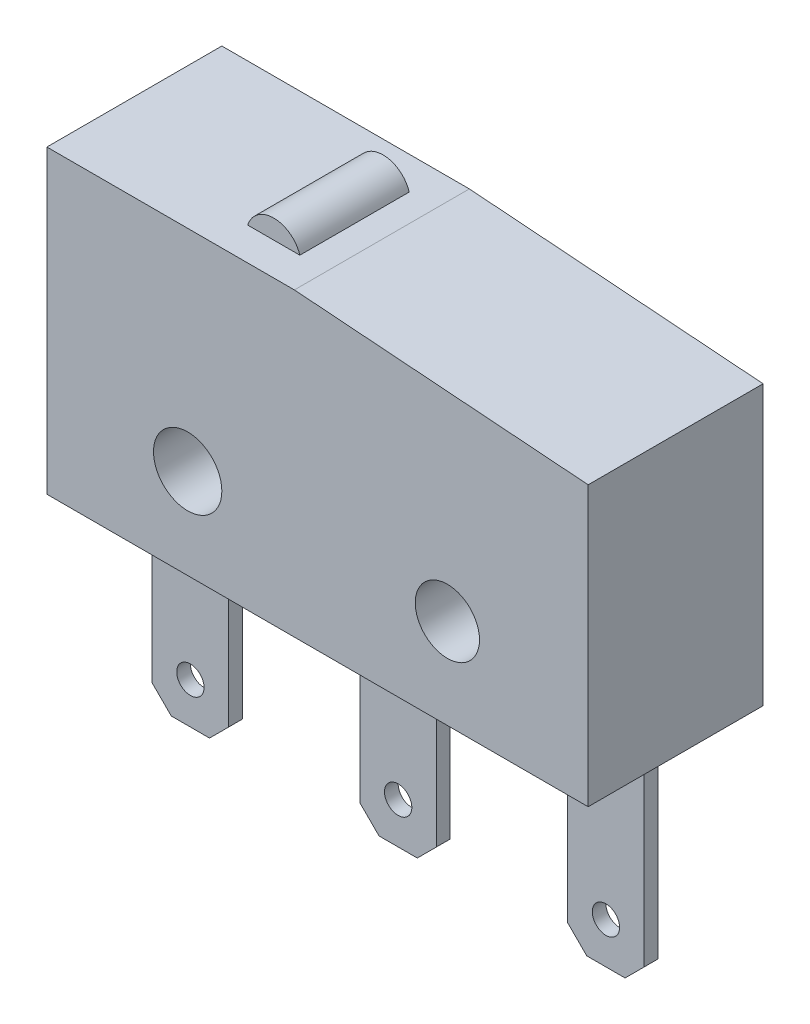
ISO-10303-21;
HEADER;
FILE_DESCRIPTION(('STEP AP214'),'2;1');
FILE_NAME('part.step','',(''),(''),'','','');
FILE_SCHEMA(('AUTOMOTIVE_DESIGN { 1 0 10303 214 1 1 1 1 }'));
ENDSEC;
DATA;
#1=APPLICATION_CONTEXT('core data for automotive mechanical design processes');
#2=APPLICATION_PROTOCOL_DEFINITION('international standard','automotive_design',2000,#1);
#3=PRODUCT_CONTEXT('',#1,'mechanical');
#4=PRODUCT('Part','Part','',(#3));
#5=PRODUCT_RELATED_PRODUCT_CATEGORY('part','',(#4));
#6=PRODUCT_DEFINITION_FORMATION('','',#4);
#7=PRODUCT_DEFINITION_CONTEXT('part definition',#1,'design');
#8=PRODUCT_DEFINITION('design','',#6,#7);
#9=PRODUCT_DEFINITION_SHAPE('','',#8);
#10=(LENGTH_UNIT() NAMED_UNIT(*) SI_UNIT(.MILLI.,.METRE.));
#11=(NAMED_UNIT(*) PLANE_ANGLE_UNIT() SI_UNIT($,.RADIAN.));
#12=(NAMED_UNIT(*) SI_UNIT($,.STERADIAN.) SOLID_ANGLE_UNIT());
#13=UNCERTAINTY_MEASURE_WITH_UNIT(LENGTH_MEASURE(1.E-05),#10,'distance_accuracy_value','');
#14=(GEOMETRIC_REPRESENTATION_CONTEXT(3) GLOBAL_UNCERTAINTY_ASSIGNED_CONTEXT((#13)) GLOBAL_UNIT_ASSIGNED_CONTEXT((#10,
#11,#12)) REPRESENTATION_CONTEXT('',''));
#15=CARTESIAN_POINT('',(0.,0.,0.));
#16=DIRECTION('',(0.,0.,1.));
#17=DIRECTION('',(1.,0.,0.));
#18=AXIS2_PLACEMENT_3D('',#15,#16,#17);
#19=CARTESIAN_POINT('',(1.95,7.4,3.2));
#20=DIRECTION('',(0.,0.,-1.));
#21=DIRECTION('',(-1.,0.,0.));
#22=AXIS2_PLACEMENT_3D('',#19,#20,#21);
#23=CYLINDRICAL_SURFACE('',#22,1.);
#24=CARTESIAN_POINT('',(1.95,7.4,2.));
#25=DIRECTION('',(0.,0.,1.));
#26=DIRECTION('',(1.,0.,0.));
#27=AXIS2_PLACEMENT_3D('',#24,#25,#26);
#28=CIRCLE('',#27,1.);
#29=CARTESIAN_POINT('',(2.90393920141694,7.7,2.));
#30=VERTEX_POINT('',#29);
#31=CARTESIAN_POINT('',(0.99606079858305,7.7,2.));
#32=VERTEX_POINT('',#31);
#33=EDGE_CURVE('E47',#30,#32,#28,.T.);
#34=ORIENTED_EDGE('',*,*,#33,.F.);
#35=DIRECTION('',(0.,0.,-1.));
#36=VECTOR('',#35,1.);
#37=CARTESIAN_POINT('',(2.90393920141694,7.7,3.2));
#38=LINE('',#37,#36);
#39=CARTESIAN_POINT('',(2.90393920141694,7.7,-2.));
#40=VERTEX_POINT('',#39);
#41=EDGE_CURVE('E205',#30,#40,#38,.T.);
#42=ORIENTED_EDGE('',*,*,#41,.T.);
#43=CARTESIAN_POINT('',(1.95,7.4,-2.));
#44=DIRECTION('',(0.,0.,-1.));
#45=DIRECTION('',(-1.,0.,0.));
#46=AXIS2_PLACEMENT_3D('',#43,#44,#45);
#47=CIRCLE('',#46,1.);
#48=CARTESIAN_POINT('',(0.99606079858305,7.7,-2.));
#49=VERTEX_POINT('',#48);
#50=EDGE_CURVE('E11',#49,#40,#47,.T.);
#51=ORIENTED_EDGE('',*,*,#50,.F.);
#52=DIRECTION('',(0.,0.,-1.));
#53=VECTOR('',#52,1.);
#54=CARTESIAN_POINT('',(0.99606079858305,7.7,3.2));
#55=LINE('',#54,#53);
#56=EDGE_CURVE('E206',#32,#49,#55,.T.);
#57=ORIENTED_EDGE('',*,*,#56,.F.);
#58=EDGE_LOOP('',(#34,#42,#51,#57));
#59=FACE_BOUND('',#58,.T.);
#60=ADVANCED_FACE('F33',(#59),#23,.T.);
#61=CARTESIAN_POINT('',(1.95,7.4,-3.2));
#62=DIRECTION('',(0.,0.,1.));
#63=DIRECTION('',(1.,0.,0.));
#64=AXIS2_PLACEMENT_3D('',#61,#62,#63);
#65=PLANE('',#64);
#66=CARTESIAN_POINT('',(9.5,0.,-3.2));
#67=DIRECTION('',(0.,0.,1.));
#68=DIRECTION('',(1.,0.,0.));
#69=AXIS2_PLACEMENT_3D('',#66,#67,#68);
#70=CIRCLE('',#69,1.175);
#71=CARTESIAN_POINT('',(10.675,0.,-3.2));
#72=VERTEX_POINT('',#71);
#73=EDGE_CURVE('E273',#72,#72,#70,.T.);
#74=ORIENTED_EDGE('',*,*,#73,.T.);
#75=EDGE_LOOP('',(#74));
#76=FACE_BOUND('',#75,.T.);
#77=CARTESIAN_POINT('',(0.,0.,-3.2));
#78=DIRECTION('',(0.,0.,1.));
#79=DIRECTION('',(1.,0.,0.));
#80=AXIS2_PLACEMENT_3D('',#77,#78,#79);
#81=CIRCLE('',#80,1.25);
#82=CARTESIAN_POINT('',(1.25,0.,-3.2));
#83=VERTEX_POINT('',#82);
#84=EDGE_CURVE('E248',#83,#83,#81,.T.);
#85=ORIENTED_EDGE('',*,*,#84,.T.);
#86=EDGE_LOOP('',(#85));
#87=FACE_BOUND('',#86,.T.);
#88=DIRECTION('',(-1.,0.,0.));
#89=VECTOR('',#88,1.);
#90=CARTESIAN_POINT('',(0.99606079858305,7.7,-3.2));
#91=LINE('',#90,#89);
#92=CARTESIAN_POINT('',(3.90393920141694,7.7,-3.2));
#93=VERTEX_POINT('',#92);
#94=CARTESIAN_POINT('',(-5.15,7.7,-3.2));
#95=VERTEX_POINT('',#94);
#96=EDGE_CURVE('E258',#93,#95,#91,.T.);
#97=ORIENTED_EDGE('',*,*,#96,.F.);
#98=DIRECTION('',(-0.997240370656576,0.0742404413560044,0.));
#99=VECTOR('',#98,1.);
#100=CARTESIAN_POINT('',(14.65,6.9,-3.2));
#101=LINE('',#100,#99);
#102=CARTESIAN_POINT('',(14.65,6.9,-3.2));
#103=VERTEX_POINT('',#102);
#104=EDGE_CURVE('E255',#103,#93,#101,.T.);
#105=ORIENTED_EDGE('',*,*,#104,.F.);
#106=DIRECTION('',(0.,1.,0.));
#107=VECTOR('',#106,1.);
#108=CARTESIAN_POINT('',(14.65,-3.3,-3.2));
#109=LINE('',#108,#107);
#110=CARTESIAN_POINT('',(14.65,-3.3,-3.2));
#111=VERTEX_POINT('',#110);
#112=EDGE_CURVE('E245',#111,#103,#109,.T.);
#113=ORIENTED_EDGE('',*,*,#112,.F.);
#114=DIRECTION('',(1.,0.,0.));
#115=VECTOR('',#114,1.);
#116=CARTESIAN_POINT('',(-5.15,-3.3,-3.2));
#117=LINE('',#116,#115);
#118=CARTESIAN_POINT('',(-5.15,-3.3,-3.2));
#119=VERTEX_POINT('',#118);
#120=EDGE_CURVE('E232',#119,#111,#117,.T.);
#121=ORIENTED_EDGE('',*,*,#120,.F.);
#122=DIRECTION('',(0.,-1.,0.));
#123=VECTOR('',#122,1.);
#124=CARTESIAN_POINT('',(-5.15,7.7,-3.2));
#125=LINE('',#124,#123);
#126=EDGE_CURVE('E239',#95,#119,#125,.T.);
#127=ORIENTED_EDGE('',*,*,#126,.F.);
#128=EDGE_LOOP('',(#97,#105,#113,#121,#127));
#129=FACE_BOUND('',#128,.T.);
#130=ADVANCED_FACE('F454',(#76,#87,#129),#65,.F.);
#131=CARTESIAN_POINT('',(-5.15,-3.3,3.2));
#132=DIRECTION('',(0.,1.,0.));
#133=DIRECTION('',(-1.,0.,0.));
#134=AXIS2_PLACEMENT_3D('',#131,#132,#133);
#135=PLANE('',#134);
#136=DIRECTION('',(0.,0.,-1.));
#137=VECTOR('',#136,1.);
#138=CARTESIAN_POINT('',(3.35,-3.3,0.25));
#139=LINE('',#138,#137);
#140=CARTESIAN_POINT('',(3.35,-3.3,0.25));
#141=VERTEX_POINT('',#140);
#142=CARTESIAN_POINT('',(3.35,-3.3,-0.25));
#143=VERTEX_POINT('',#142);
#144=EDGE_CURVE('E344',#141,#143,#139,.T.);
#145=ORIENTED_EDGE('',*,*,#144,.F.);
#146=DIRECTION('',(-1.,0.,0.));
#147=VECTOR('',#146,1.);
#148=CARTESIAN_POINT('',(3.35,-3.3,0.25));
#149=LINE('',#148,#147);
#150=CARTESIAN_POINT('',(6.15,-3.3,0.25));
#151=VERTEX_POINT('',#150);
#152=EDGE_CURVE('E347',#151,#141,#149,.T.);
#153=ORIENTED_EDGE('',*,*,#152,.F.);
#154=DIRECTION('',(0.,0.,-1.));
#155=VECTOR('',#154,1.);
#156=CARTESIAN_POINT('',(6.15,-3.3,0.25));
#157=LINE('',#156,#155);
#158=CARTESIAN_POINT('',(6.15,-3.3,-0.25));
#159=VERTEX_POINT('',#158);
#160=EDGE_CURVE('E342',#151,#159,#157,.T.);
#161=ORIENTED_EDGE('',*,*,#160,.T.);
#162=DIRECTION('',(-1.,0.,0.));
#163=VECTOR('',#162,1.);
#164=CARTESIAN_POINT('',(3.35,-3.3,-0.25));
#165=LINE('',#164,#163);
#166=EDGE_CURVE('E348',#159,#143,#165,.T.);
#167=ORIENTED_EDGE('',*,*,#166,.T.);
#168=EDGE_LOOP('',(#145,#153,#161,#167));
#169=FACE_BOUND('',#168,.T.);
#170=ORIENTED_EDGE('',*,*,#120,.T.);
#171=DIRECTION('',(0.,0.,-1.));
#172=VECTOR('',#171,1.);
#173=CARTESIAN_POINT('',(14.65,-3.3,3.2));
#174=LINE('',#173,#172);
#175=CARTESIAN_POINT('',(14.65,-3.3,3.2));
#176=VERTEX_POINT('',#175);
#177=EDGE_CURVE('E223',#176,#111,#174,.T.);
#178=ORIENTED_EDGE('',*,*,#177,.F.);
#179=DIRECTION('',(1.,0.,0.));
#180=VECTOR('',#179,1.);
#181=CARTESIAN_POINT('',(-5.15,-3.3,3.2));
#182=LINE('',#181,#180);
#183=CARTESIAN_POINT('',(-5.15,-3.3,3.2));
#184=VERTEX_POINT('',#183);
#185=EDGE_CURVE('E233',#184,#176,#182,.T.);
#186=ORIENTED_EDGE('',*,*,#185,.F.);
#187=DIRECTION('',(0.,0.,-1.));
#188=VECTOR('',#187,1.);
#189=CARTESIAN_POINT('',(-5.15,-3.3,3.2));
#190=LINE('',#189,#188);
#191=EDGE_CURVE('E41',#184,#119,#190,.T.);
#192=ORIENTED_EDGE('',*,*,#191,.T.);
#193=EDGE_LOOP('',(#170,#178,#186,#192));
#194=FACE_BOUND('',#193,.T.);
#195=DIRECTION('',(0.,0.,-1.));
#196=VECTOR('',#195,1.);
#197=CARTESIAN_POINT('',(-4.25,-3.3,0.25));
#198=LINE('',#197,#196);
#199=CARTESIAN_POINT('',(-4.25,-3.3,0.25));
#200=VERTEX_POINT('',#199);
#201=CARTESIAN_POINT('',(-4.25,-3.3,-0.25));
#202=VERTEX_POINT('',#201);
#203=EDGE_CURVE('E292',#200,#202,#198,.T.);
#204=ORIENTED_EDGE('',*,*,#203,.F.);
#205=DIRECTION('',(-1.,0.,0.));
#206=VECTOR('',#205,1.);
#207=CARTESIAN_POINT('',(-4.25,-3.3,0.25));
#208=LINE('',#207,#206);
#209=CARTESIAN_POINT('',(-1.45,-3.3,0.25));
#210=VERTEX_POINT('',#209);
#211=EDGE_CURVE('E295',#210,#200,#208,.T.);
#212=ORIENTED_EDGE('',*,*,#211,.F.);
#213=DIRECTION('',(0.,0.,-1.));
#214=VECTOR('',#213,1.);
#215=CARTESIAN_POINT('',(-1.45,-3.3,0.25));
#216=LINE('',#215,#214);
#217=CARTESIAN_POINT('',(-1.45,-3.3,-0.25));
#218=VERTEX_POINT('',#217);
#219=EDGE_CURVE('E290',#210,#218,#216,.T.);
#220=ORIENTED_EDGE('',*,*,#219,.T.);
#221=DIRECTION('',(-1.,0.,0.));
#222=VECTOR('',#221,1.);
#223=CARTESIAN_POINT('',(-4.25,-3.3,-0.25));
#224=LINE('',#223,#222);
#225=EDGE_CURVE('E296',#218,#202,#224,.T.);
#226=ORIENTED_EDGE('',*,*,#225,.T.);
#227=EDGE_LOOP('',(#204,#212,#220,#226));
#228=FACE_BOUND('',#227,.T.);
#229=DIRECTION('',(0.,0.,-1.));
#230=VECTOR('',#229,1.);
#231=CARTESIAN_POINT('',(10.95,-3.3,0.25));
#232=LINE('',#231,#230);
#233=CARTESIAN_POINT('',(10.95,-3.3,0.25));
#234=VERTEX_POINT('',#233);
#235=CARTESIAN_POINT('',(10.95,-3.3,-0.25));
#236=VERTEX_POINT('',#235);
#237=EDGE_CURVE('E55',#234,#236,#232,.T.);
#238=ORIENTED_EDGE('',*,*,#237,.F.);
#239=DIRECTION('',(-1.,0.,0.));
#240=VECTOR('',#239,1.);
#241=CARTESIAN_POINT('',(10.95,-3.3,0.25));
#242=LINE('',#241,#240);
#243=CARTESIAN_POINT('',(13.75,-3.3,0.25));
#244=VERTEX_POINT('',#243);
#245=EDGE_CURVE('E397',#244,#234,#242,.T.);
#246=ORIENTED_EDGE('',*,*,#245,.F.);
#247=DIRECTION('',(0.,0.,-1.));
#248=VECTOR('',#247,1.);
#249=CARTESIAN_POINT('',(13.75,-3.3,0.25));
#250=LINE('',#249,#248);
#251=CARTESIAN_POINT('',(13.75,-3.3,-0.25));
#252=VERTEX_POINT('',#251);
#253=EDGE_CURVE('E394',#244,#252,#250,.T.);
#254=ORIENTED_EDGE('',*,*,#253,.T.);
#255=DIRECTION('',(-1.,0.,0.));
#256=VECTOR('',#255,1.);
#257=CARTESIAN_POINT('',(10.95,-3.3,-0.25));
#258=LINE('',#257,#256);
#259=EDGE_CURVE('E398',#252,#236,#258,.T.);
#260=ORIENTED_EDGE('',*,*,#259,.T.);
#261=EDGE_LOOP('',(#238,#246,#254,#260));
#262=FACE_BOUND('',#261,.T.);
#263=ADVANCED_FACE('F229',(#169,#194,#228,#262),#135,.F.);
#264=CARTESIAN_POINT('',(1.95,7.4,3.2));
#265=DIRECTION('',(0.,0.,1.));
#266=DIRECTION('',(1.,0.,0.));
#267=AXIS2_PLACEMENT_3D('',#264,#265,#266);
#268=PLANE('',#267);
#269=DIRECTION('',(-1.,0.,0.));
#270=VECTOR('',#269,1.);
#271=CARTESIAN_POINT('',(3.90393920141694,7.7,3.2));
#272=LINE('',#271,#270);
#273=CARTESIAN_POINT('',(3.90393920141694,7.7,3.2));
#274=VERTEX_POINT('',#273);
#275=CARTESIAN_POINT('',(-5.15,7.7,3.2));
#276=VERTEX_POINT('',#275);
#277=EDGE_CURVE('E251',#274,#276,#272,.T.);
#278=ORIENTED_EDGE('',*,*,#277,.T.);
#279=DIRECTION('',(0.,-1.,0.));
#280=VECTOR('',#279,1.);
#281=CARTESIAN_POINT('',(-5.15,7.7,3.2));
#282=LINE('',#281,#280);
#283=EDGE_CURVE('E259',#276,#184,#282,.T.);
#284=ORIENTED_EDGE('',*,*,#283,.T.);
#285=ORIENTED_EDGE('',*,*,#185,.T.);
#286=DIRECTION('',(0.,1.,0.));
#287=VECTOR('',#286,1.);
#288=CARTESIAN_POINT('',(14.65,-3.3,3.2));
#289=LINE('',#288,#287);
#290=CARTESIAN_POINT('',(14.65,6.9,3.2));
#291=VERTEX_POINT('',#290);
#292=EDGE_CURVE('E263',#176,#291,#289,.T.);
#293=ORIENTED_EDGE('',*,*,#292,.T.);
#294=DIRECTION('',(-0.997240370656576,0.0742404413560044,0.));
#295=VECTOR('',#294,1.);
#296=CARTESIAN_POINT('',(14.65,6.9,3.2));
#297=LINE('',#296,#295);
#298=EDGE_CURVE('E260',#291,#274,#297,.T.);
#299=ORIENTED_EDGE('',*,*,#298,.T.);
#300=EDGE_LOOP('',(#278,#284,#285,#293,#299));
#301=FACE_BOUND('',#300,.T.);
#302=CARTESIAN_POINT('',(0.,0.,3.2));
#303=DIRECTION('',(0.,0.,1.));
#304=DIRECTION('',(1.,0.,0.));
#305=AXIS2_PLACEMENT_3D('',#302,#303,#304);
#306=CIRCLE('',#305,1.25);
#307=CARTESIAN_POINT('',(1.25,0.,3.2));
#308=VERTEX_POINT('',#307);
#309=EDGE_CURVE('E243',#308,#308,#306,.T.);
#310=ORIENTED_EDGE('',*,*,#309,.F.);
#311=EDGE_LOOP('',(#310));
#312=FACE_BOUND('',#311,.T.);
#313=CARTESIAN_POINT('',(9.5,0.,3.2));
#314=DIRECTION('',(0.,0.,1.));
#315=DIRECTION('',(1.,0.,0.));
#316=AXIS2_PLACEMENT_3D('',#313,#314,#315);
#317=CIRCLE('',#316,1.175);
#318=CARTESIAN_POINT('',(10.675,0.,3.2));
#319=VERTEX_POINT('',#318);
#320=EDGE_CURVE('E271',#319,#319,#317,.T.);
#321=ORIENTED_EDGE('',*,*,#320,.F.);
#322=EDGE_LOOP('',(#321));
#323=FACE_BOUND('',#322,.T.);
#324=ADVANCED_FACE('F471',(#301,#312,#323),#268,.T.);
#325=CARTESIAN_POINT('',(-5.15,7.7,3.2));
#326=DIRECTION('',(1.,0.,0.));
#327=DIRECTION('',(0.,1.,0.));
#328=AXIS2_PLACEMENT_3D('',#325,#326,#327);
#329=PLANE('',#328);
#330=ORIENTED_EDGE('',*,*,#126,.T.);
#331=ORIENTED_EDGE('',*,*,#191,.F.);
#332=ORIENTED_EDGE('',*,*,#283,.F.);
#333=DIRECTION('',(0.,0.,-1.));
#334=VECTOR('',#333,1.);
#335=CARTESIAN_POINT('',(-5.15,7.7,3.2));
#336=LINE('',#335,#334);
#337=EDGE_CURVE('E217',#276,#95,#336,.T.);
#338=ORIENTED_EDGE('',*,*,#337,.T.);
#339=EDGE_LOOP('',(#330,#331,#332,#338));
#340=FACE_BOUND('',#339,.T.);
#341=ADVANCED_FACE('F35',(#340),#329,.F.);
#342=CARTESIAN_POINT('',(14.65,-3.3,3.2));
#343=DIRECTION('',(-1.,0.,0.));
#344=DIRECTION('',(0.,0.,1.));
#345=AXIS2_PLACEMENT_3D('',#342,#343,#344);
#346=PLANE('',#345);
#347=ORIENTED_EDGE('',*,*,#112,.T.);
#348=DIRECTION('',(0.,0.,-1.));
#349=VECTOR('',#348,1.);
#350=CARTESIAN_POINT('',(14.65,6.9,3.2));
#351=LINE('',#350,#349);
#352=EDGE_CURVE('E215',#291,#103,#351,.T.);
#353=ORIENTED_EDGE('',*,*,#352,.F.);
#354=ORIENTED_EDGE('',*,*,#292,.F.);
#355=ORIENTED_EDGE('',*,*,#177,.T.);
#356=EDGE_LOOP('',(#347,#353,#354,#355));
#357=FACE_BOUND('',#356,.T.);
#358=ADVANCED_FACE('F466',(#357),#346,.F.);
#359=CARTESIAN_POINT('',(14.65,6.9,3.2));
#360=DIRECTION('',(-0.0742404413560043,-0.997240370656576,0.));
#361=DIRECTION('',(0.997240370656576,-0.0742404413560043,0.));
#362=AXIS2_PLACEMENT_3D('',#359,#360,#361);
#363=PLANE('',#362);
#364=ORIENTED_EDGE('',*,*,#104,.T.);
#365=DIRECTION('',(0.,0.,-1.));
#366=VECTOR('',#365,1.);
#367=CARTESIAN_POINT('',(3.90393920141694,7.7,3.2));
#368=LINE('',#367,#366);
#369=EDGE_CURVE('E213',#274,#93,#368,.T.);
#370=ORIENTED_EDGE('',*,*,#369,.F.);
#371=ORIENTED_EDGE('',*,*,#298,.F.);
#372=ORIENTED_EDGE('',*,*,#352,.T.);
#373=EDGE_LOOP('',(#364,#370,#371,#372));
#374=FACE_BOUND('',#373,.T.);
#375=ADVANCED_FACE('F463',(#374),#363,.F.);
#376=CARTESIAN_POINT('',(0.99606079858305,7.7,3.2));
#377=DIRECTION('',(0.,-1.,0.));
#378=DIRECTION('',(0.,0.,-1.));
#379=AXIS2_PLACEMENT_3D('',#376,#377,#378);
#380=PLANE('',#379);
#381=ORIENTED_EDGE('',*,*,#41,.F.);
#382=DIRECTION('',(-1.,0.,0.));
#383=VECTOR('',#382,1.);
#384=CARTESIAN_POINT('',(0.99606079858305,7.7,2.));
#385=LINE('',#384,#383);
#386=EDGE_CURVE('E197',#30,#32,#385,.T.);
#387=ORIENTED_EDGE('',*,*,#386,.T.);
#388=ORIENTED_EDGE('',*,*,#56,.T.);
#389=DIRECTION('',(1.,0.,0.));
#390=VECTOR('',#389,1.);
#391=CARTESIAN_POINT('',(0.99606079858305,7.7,-2.));
#392=LINE('',#391,#390);
#393=EDGE_CURVE('E207',#49,#40,#392,.T.);
#394=ORIENTED_EDGE('',*,*,#393,.T.);
#395=EDGE_LOOP('',(#381,#387,#388,#394));
#396=FACE_BOUND('',#395,.T.);
#397=ORIENTED_EDGE('',*,*,#369,.T.);
#398=ORIENTED_EDGE('',*,*,#96,.T.);
#399=ORIENTED_EDGE('',*,*,#337,.F.);
#400=ORIENTED_EDGE('',*,*,#277,.F.);
#401=EDGE_LOOP('',(#397,#398,#399,#400));
#402=FACE_BOUND('',#401,.T.);
#403=ADVANCED_FACE('F210',(#396,#402),#380,.F.);
#404=CARTESIAN_POINT('',(0.,0.,3.2));
#405=DIRECTION('',(0.,0.,-1.));
#406=DIRECTION('',(-1.,0.,0.));
#407=AXIS2_PLACEMENT_3D('',#404,#405,#406);
#408=CYLINDRICAL_SURFACE('',#407,1.25);
#409=ORIENTED_EDGE('',*,*,#309,.T.);
#410=EDGE_LOOP('',(#409));
#411=FACE_BOUND('',#410,.T.);
#412=ORIENTED_EDGE('',*,*,#84,.F.);
#413=EDGE_LOOP('',(#412));
#414=FACE_BOUND('',#413,.T.);
#415=ADVANCED_FACE('F560',(#411,#414),#408,.F.);
#416=CARTESIAN_POINT('',(9.5,0.,3.2));
#417=DIRECTION('',(0.,0.,-1.));
#418=DIRECTION('',(-1.,0.,0.));
#419=AXIS2_PLACEMENT_3D('',#416,#417,#418);
#420=CYLINDRICAL_SURFACE('',#419,1.175);
#421=ORIENTED_EDGE('',*,*,#320,.T.);
#422=EDGE_LOOP('',(#421));
#423=FACE_BOUND('',#422,.T.);
#424=ORIENTED_EDGE('',*,*,#73,.F.);
#425=EDGE_LOOP('',(#424));
#426=FACE_BOUND('',#425,.T.);
#427=ADVANCED_FACE('F534',(#423,#426),#420,.F.);
#428=CARTESIAN_POINT('',(-4.25,-11.,0.25));
#429=DIRECTION('',(0.,0.,1.));
#430=DIRECTION('',(1.,0.,0.));
#431=AXIS2_PLACEMENT_3D('',#428,#429,#430);
#432=PLANE('',#431);
#433=DIRECTION('',(0.,-1.,0.));
#434=VECTOR('',#433,1.);
#435=CARTESIAN_POINT('',(-4.25,-3.3,0.25));
#436=LINE('',#435,#434);
#437=CARTESIAN_POINT('',(-4.25,-10.3,0.25));
#438=VERTEX_POINT('',#437);
#439=EDGE_CURVE('E298',#200,#438,#436,.T.);
#440=ORIENTED_EDGE('',*,*,#439,.T.);
#441=DIRECTION('',(0.707106781186548,-0.707106781186547,0.));
#442=VECTOR('',#441,1.);
#443=CARTESIAN_POINT('',(-4.25,-10.3,0.25));
#444=LINE('',#443,#442);
#445=CARTESIAN_POINT('',(-3.55,-11.,0.25));
#446=VERTEX_POINT('',#445);
#447=EDGE_CURVE('E321',#438,#446,#444,.T.);
#448=ORIENTED_EDGE('',*,*,#447,.T.);
#449=DIRECTION('',(1.,0.,0.));
#450=VECTOR('',#449,1.);
#451=CARTESIAN_POINT('',(-3.55,-11.,0.25));
#452=LINE('',#451,#450);
#453=CARTESIAN_POINT('',(-2.15,-11.,0.25));
#454=VERTEX_POINT('',#453);
#455=EDGE_CURVE('E319',#446,#454,#452,.T.);
#456=ORIENTED_EDGE('',*,*,#455,.T.);
#457=DIRECTION('',(0.707106781186549,0.707106781186546,0.));
#458=VECTOR('',#457,1.);
#459=CARTESIAN_POINT('',(-2.15,-11.,0.25));
#460=LINE('',#459,#458);
#461=CARTESIAN_POINT('',(-1.45,-10.3,0.25));
#462=VERTEX_POINT('',#461);
#463=EDGE_CURVE('E317',#454,#462,#460,.T.);
#464=ORIENTED_EDGE('',*,*,#463,.T.);
#465=DIRECTION('',(0.,1.,0.));
#466=VECTOR('',#465,1.);
#467=CARTESIAN_POINT('',(-1.45,-3.3,0.25));
#468=LINE('',#467,#466);
#469=EDGE_CURVE('E314',#462,#210,#468,.T.);
#470=ORIENTED_EDGE('',*,*,#469,.T.);
#471=ORIENTED_EDGE('',*,*,#211,.T.);
#472=EDGE_LOOP('',(#440,#448,#456,#464,#470,#471));
#473=FACE_BOUND('',#472,.T.);
#474=CARTESIAN_POINT('',(-2.85,-9.5,0.25));
#475=DIRECTION('',(0.,0.,1.));
#476=DIRECTION('',(1.,0.,0.));
#477=AXIS2_PLACEMENT_3D('',#474,#475,#476);
#478=CIRCLE('',#477,0.5);
#479=CARTESIAN_POINT('',(-2.35,-9.5,0.25));
#480=VERTEX_POINT('',#479);
#481=EDGE_CURVE('E311',#480,#480,#478,.T.);
#482=ORIENTED_EDGE('',*,*,#481,.F.);
#483=EDGE_LOOP('',(#482));
#484=FACE_BOUND('',#483,.T.);
#485=ADVANCED_FACE('F530',(#473,#484),#432,.T.);
#486=CARTESIAN_POINT('',(-4.25,-11.,-0.25));
#487=DIRECTION('',(0.,0.,1.));
#488=DIRECTION('',(1.,0.,0.));
#489=AXIS2_PLACEMENT_3D('',#486,#487,#488);
#490=PLANE('',#489);
#491=DIRECTION('',(0.,-1.,0.));
#492=VECTOR('',#491,1.);
#493=CARTESIAN_POINT('',(-4.25,-3.3,-0.25));
#494=LINE('',#493,#492);
#495=CARTESIAN_POINT('',(-4.25,-10.3,-0.25));
#496=VERTEX_POINT('',#495);
#497=EDGE_CURVE('E308',#202,#496,#494,.T.);
#498=ORIENTED_EDGE('',*,*,#497,.F.);
#499=ORIENTED_EDGE('',*,*,#225,.F.);
#500=DIRECTION('',(0.,1.,0.));
#501=VECTOR('',#500,1.);
#502=CARTESIAN_POINT('',(-1.45,-3.3,-0.25));
#503=LINE('',#502,#501);
#504=CARTESIAN_POINT('',(-1.45,-10.3,-0.25));
#505=VERTEX_POINT('',#504);
#506=EDGE_CURVE('E299',#505,#218,#503,.T.);
#507=ORIENTED_EDGE('',*,*,#506,.F.);
#508=DIRECTION('',(0.707106781186549,0.707106781186546,0.));
#509=VECTOR('',#508,1.);
#510=CARTESIAN_POINT('',(-2.15,-11.,-0.25));
#511=LINE('',#510,#509);
#512=CARTESIAN_POINT('',(-2.15,-11.,-0.25));
#513=VERTEX_POINT('',#512);
#514=EDGE_CURVE('E302',#513,#505,#511,.T.);
#515=ORIENTED_EDGE('',*,*,#514,.F.);
#516=DIRECTION('',(1.,0.,0.));
#517=VECTOR('',#516,1.);
#518=CARTESIAN_POINT('',(-3.55,-11.,-0.25));
#519=LINE('',#518,#517);
#520=CARTESIAN_POINT('',(-3.55,-11.,-0.25));
#521=VERTEX_POINT('',#520);
#522=EDGE_CURVE('E304',#521,#513,#519,.T.);
#523=ORIENTED_EDGE('',*,*,#522,.F.);
#524=DIRECTION('',(0.707106781186548,-0.707106781186547,0.));
#525=VECTOR('',#524,1.);
#526=CARTESIAN_POINT('',(-4.25,-10.3,-0.25));
#527=LINE('',#526,#525);
#528=EDGE_CURVE('E306',#496,#521,#527,.T.);
#529=ORIENTED_EDGE('',*,*,#528,.F.);
#530=EDGE_LOOP('',(#498,#499,#507,#515,#523,#529));
#531=FACE_BOUND('',#530,.T.);
#532=CARTESIAN_POINT('',(-2.85,-9.5,-0.25));
#533=DIRECTION('',(0.,0.,1.));
#534=DIRECTION('',(1.,0.,0.));
#535=AXIS2_PLACEMENT_3D('',#532,#533,#534);
#536=CIRCLE('',#535,0.5);
#537=CARTESIAN_POINT('',(-2.35,-9.5,-0.25));
#538=VERTEX_POINT('',#537);
#539=EDGE_CURVE('E325',#538,#538,#536,.T.);
#540=ORIENTED_EDGE('',*,*,#539,.T.);
#541=EDGE_LOOP('',(#540));
#542=FACE_BOUND('',#541,.T.);
#543=ADVANCED_FACE('F533',(#531,#542),#490,.F.);
#544=CARTESIAN_POINT('',(-4.25,-3.3,0.25));
#545=DIRECTION('',(1.,0.,0.));
#546=DIRECTION('',(0.,0.,-1.));
#547=AXIS2_PLACEMENT_3D('',#544,#545,#546);
#548=PLANE('',#547);
#549=ORIENTED_EDGE('',*,*,#497,.T.);
#550=DIRECTION('',(0.,0.,-1.));
#551=VECTOR('',#550,1.);
#552=CARTESIAN_POINT('',(-4.25,-10.3,0.25));
#553=LINE('',#552,#551);
#554=EDGE_CURVE('E276',#438,#496,#553,.T.);
#555=ORIENTED_EDGE('',*,*,#554,.F.);
#556=ORIENTED_EDGE('',*,*,#439,.F.);
#557=ORIENTED_EDGE('',*,*,#203,.T.);
#558=EDGE_LOOP('',(#549,#555,#556,#557));
#559=FACE_BOUND('',#558,.T.);
#560=ADVANCED_FACE('F538',(#559),#548,.F.);
#561=CARTESIAN_POINT('',(-4.25,-10.3,0.25));
#562=DIRECTION('',(0.707106781186547,0.707106781186548,0.));
#563=DIRECTION('',(-0.707106781186548,0.707106781186547,0.));
#564=AXIS2_PLACEMENT_3D('',#561,#562,#563);
#565=PLANE('',#564);
#566=ORIENTED_EDGE('',*,*,#528,.T.);
#567=DIRECTION('',(0.,0.,-1.));
#568=VECTOR('',#567,1.);
#569=CARTESIAN_POINT('',(-3.55,-11.,0.25));
#570=LINE('',#569,#568);
#571=EDGE_CURVE('E281',#446,#521,#570,.T.);
#572=ORIENTED_EDGE('',*,*,#571,.F.);
#573=ORIENTED_EDGE('',*,*,#447,.F.);
#574=ORIENTED_EDGE('',*,*,#554,.T.);
#575=EDGE_LOOP('',(#566,#572,#573,#574));
#576=FACE_BOUND('',#575,.T.);
#577=ADVANCED_FACE('F550',(#576),#565,.F.);
#578=CARTESIAN_POINT('',(-3.55,-11.,0.25));
#579=DIRECTION('',(0.,1.,0.));
#580=DIRECTION('',(0.,0.,1.));
#581=AXIS2_PLACEMENT_3D('',#578,#579,#580);
#582=PLANE('',#581);
#583=ORIENTED_EDGE('',*,*,#522,.T.);
#584=DIRECTION('',(0.,0.,-1.));
#585=VECTOR('',#584,1.);
#586=CARTESIAN_POINT('',(-2.15,-11.,0.25));
#587=LINE('',#586,#585);
#588=EDGE_CURVE('E284',#454,#513,#587,.T.);
#589=ORIENTED_EDGE('',*,*,#588,.F.);
#590=ORIENTED_EDGE('',*,*,#455,.F.);
#591=ORIENTED_EDGE('',*,*,#571,.T.);
#592=EDGE_LOOP('',(#583,#589,#590,#591));
#593=FACE_BOUND('',#592,.T.);
#594=ADVANCED_FACE('F546',(#593),#582,.F.);
#595=CARTESIAN_POINT('',(-2.15,-11.,0.25));
#596=DIRECTION('',(-0.707106781186546,0.707106781186549,0.));
#597=DIRECTION('',(-0.707106781186549,-0.707106781186546,0.));
#598=AXIS2_PLACEMENT_3D('',#595,#596,#597);
#599=PLANE('',#598);
#600=ORIENTED_EDGE('',*,*,#514,.T.);
#601=DIRECTION('',(0.,0.,-1.));
#602=VECTOR('',#601,1.);
#603=CARTESIAN_POINT('',(-1.45,-10.3,0.25));
#604=LINE('',#603,#602);
#605=EDGE_CURVE('E287',#462,#505,#604,.T.);
#606=ORIENTED_EDGE('',*,*,#605,.F.);
#607=ORIENTED_EDGE('',*,*,#463,.F.);
#608=ORIENTED_EDGE('',*,*,#588,.T.);
#609=EDGE_LOOP('',(#600,#606,#607,#608));
#610=FACE_BOUND('',#609,.T.);
#611=ADVANCED_FACE('F542',(#610),#599,.F.);
#612=CARTESIAN_POINT('',(-1.45,-3.3,0.25));
#613=DIRECTION('',(-1.,0.,0.));
#614=DIRECTION('',(0.,-1.,0.));
#615=AXIS2_PLACEMENT_3D('',#612,#613,#614);
#616=PLANE('',#615);
#617=ORIENTED_EDGE('',*,*,#506,.T.);
#618=ORIENTED_EDGE('',*,*,#219,.F.);
#619=ORIENTED_EDGE('',*,*,#469,.F.);
#620=ORIENTED_EDGE('',*,*,#605,.T.);
#621=EDGE_LOOP('',(#617,#618,#619,#620));
#622=FACE_BOUND('',#621,.T.);
#623=ADVANCED_FACE('F528',(#622),#616,.F.);
#624=CARTESIAN_POINT('',(-2.85,-9.5,0.25));
#625=DIRECTION('',(0.,0.,-1.));
#626=DIRECTION('',(-1.,0.,0.));
#627=AXIS2_PLACEMENT_3D('',#624,#625,#626);
#628=CYLINDRICAL_SURFACE('',#627,0.5);
#629=ORIENTED_EDGE('',*,*,#481,.T.);
#630=EDGE_LOOP('',(#629));
#631=FACE_BOUND('',#630,.T.);
#632=ORIENTED_EDGE('',*,*,#539,.F.);
#633=EDGE_LOOP('',(#632));
#634=FACE_BOUND('',#633,.T.);
#635=ADVANCED_FACE('F515',(#631,#634),#628,.F.);
#636=CARTESIAN_POINT('',(3.35,-11.,0.25));
#637=DIRECTION('',(0.,0.,1.));
#638=DIRECTION('',(1.,0.,0.));
#639=AXIS2_PLACEMENT_3D('',#636,#637,#638);
#640=PLANE('',#639);
#641=DIRECTION('',(0.,-1.,0.));
#642=VECTOR('',#641,1.);
#643=CARTESIAN_POINT('',(3.35,-3.3,0.25));
#644=LINE('',#643,#642);
#645=CARTESIAN_POINT('',(3.35,-10.3,0.25));
#646=VERTEX_POINT('',#645);
#647=EDGE_CURVE('E350',#141,#646,#644,.T.);
#648=ORIENTED_EDGE('',*,*,#647,.T.);
#649=DIRECTION('',(0.707106781186548,-0.707106781186547,0.));
#650=VECTOR('',#649,1.);
#651=CARTESIAN_POINT('',(3.35,-10.3,0.25));
#652=LINE('',#651,#650);
#653=CARTESIAN_POINT('',(4.05,-11.,0.25));
#654=VERTEX_POINT('',#653);
#655=EDGE_CURVE('E373',#646,#654,#652,.T.);
#656=ORIENTED_EDGE('',*,*,#655,.T.);
#657=DIRECTION('',(1.,0.,0.));
#658=VECTOR('',#657,1.);
#659=CARTESIAN_POINT('',(4.05,-11.,0.25));
#660=LINE('',#659,#658);
#661=CARTESIAN_POINT('',(5.45,-11.,0.25));
#662=VERTEX_POINT('',#661);
#663=EDGE_CURVE('E371',#654,#662,#660,.T.);
#664=ORIENTED_EDGE('',*,*,#663,.T.);
#665=DIRECTION('',(0.707106781186548,0.707106781186547,0.));
#666=VECTOR('',#665,1.);
#667=CARTESIAN_POINT('',(5.45,-11.,0.25));
#668=LINE('',#667,#666);
#669=CARTESIAN_POINT('',(6.15,-10.3,0.25));
#670=VERTEX_POINT('',#669);
#671=EDGE_CURVE('E369',#662,#670,#668,.T.);
#672=ORIENTED_EDGE('',*,*,#671,.T.);
#673=DIRECTION('',(0.,1.,0.));
#674=VECTOR('',#673,1.);
#675=CARTESIAN_POINT('',(6.15,-3.3,0.25));
#676=LINE('',#675,#674);
#677=EDGE_CURVE('E366',#670,#151,#676,.T.);
#678=ORIENTED_EDGE('',*,*,#677,.T.);
#679=ORIENTED_EDGE('',*,*,#152,.T.);
#680=EDGE_LOOP('',(#648,#656,#664,#672,#678,#679));
#681=FACE_BOUND('',#680,.T.);
#682=CARTESIAN_POINT('',(4.75,-9.5,0.25));
#683=DIRECTION('',(0.,0.,1.));
#684=DIRECTION('',(1.,0.,0.));
#685=AXIS2_PLACEMENT_3D('',#682,#683,#684);
#686=CIRCLE('',#685,0.500000000000001);
#687=CARTESIAN_POINT('',(5.25,-9.5,0.25));
#688=VERTEX_POINT('',#687);
#689=EDGE_CURVE('E363',#688,#688,#686,.T.);
#690=ORIENTED_EDGE('',*,*,#689,.F.);
#691=EDGE_LOOP('',(#690));
#692=FACE_BOUND('',#691,.T.);
#693=ADVANCED_FACE('F482',(#681,#692),#640,.T.);
#694=CARTESIAN_POINT('',(3.35,-11.,-0.25));
#695=DIRECTION('',(0.,0.,1.));
#696=DIRECTION('',(1.,0.,0.));
#697=AXIS2_PLACEMENT_3D('',#694,#695,#696);
#698=PLANE('',#697);
#699=DIRECTION('',(0.,-1.,0.));
#700=VECTOR('',#699,1.);
#701=CARTESIAN_POINT('',(3.35,-3.3,-0.25));
#702=LINE('',#701,#700);
#703=CARTESIAN_POINT('',(3.35,-10.3,-0.25));
#704=VERTEX_POINT('',#703);
#705=EDGE_CURVE('E360',#143,#704,#702,.T.);
#706=ORIENTED_EDGE('',*,*,#705,.F.);
#707=ORIENTED_EDGE('',*,*,#166,.F.);
#708=DIRECTION('',(0.,1.,0.));
#709=VECTOR('',#708,1.);
#710=CARTESIAN_POINT('',(6.15,-3.3,-0.25));
#711=LINE('',#710,#709);
#712=CARTESIAN_POINT('',(6.15,-10.3,-0.25));
#713=VERTEX_POINT('',#712);
#714=EDGE_CURVE('E351',#713,#159,#711,.T.);
#715=ORIENTED_EDGE('',*,*,#714,.F.);
#716=DIRECTION('',(0.707106781186548,0.707106781186547,0.));
#717=VECTOR('',#716,1.);
#718=CARTESIAN_POINT('',(5.45,-11.,-0.25));
#719=LINE('',#718,#717);
#720=CARTESIAN_POINT('',(5.45,-11.,-0.25));
#721=VERTEX_POINT('',#720);
#722=EDGE_CURVE('E354',#721,#713,#719,.T.);
#723=ORIENTED_EDGE('',*,*,#722,.F.);
#724=DIRECTION('',(1.,0.,0.));
#725=VECTOR('',#724,1.);
#726=CARTESIAN_POINT('',(4.05,-11.,-0.25));
#727=LINE('',#726,#725);
#728=CARTESIAN_POINT('',(4.05,-11.,-0.25));
#729=VERTEX_POINT('',#728);
#730=EDGE_CURVE('E356',#729,#721,#727,.T.);
#731=ORIENTED_EDGE('',*,*,#730,.F.);
#732=DIRECTION('',(0.707106781186548,-0.707106781186547,0.));
#733=VECTOR('',#732,1.);
#734=CARTESIAN_POINT('',(3.35,-10.3,-0.25));
#735=LINE('',#734,#733);
#736=EDGE_CURVE('E358',#704,#729,#735,.T.);
#737=ORIENTED_EDGE('',*,*,#736,.F.);
#738=EDGE_LOOP('',(#706,#707,#715,#723,#731,#737));
#739=FACE_BOUND('',#738,.T.);
#740=CARTESIAN_POINT('',(4.75,-9.5,-0.25));
#741=DIRECTION('',(0.,0.,1.));
#742=DIRECTION('',(1.,0.,0.));
#743=AXIS2_PLACEMENT_3D('',#740,#741,#742);
#744=CIRCLE('',#743,0.500000000000001);
#745=CARTESIAN_POINT('',(5.25,-9.5,-0.25));
#746=VERTEX_POINT('',#745);
#747=EDGE_CURVE('E377',#746,#746,#744,.T.);
#748=ORIENTED_EDGE('',*,*,#747,.T.);
#749=EDGE_LOOP('',(#748));
#750=FACE_BOUND('',#749,.T.);
#751=ADVANCED_FACE('F504',(#739,#750),#698,.F.);
#752=CARTESIAN_POINT('',(3.35,-3.3,0.25));
#753=DIRECTION('',(1.,0.,0.));
#754=DIRECTION('',(0.,0.,-1.));
#755=AXIS2_PLACEMENT_3D('',#752,#753,#754);
#756=PLANE('',#755);
#757=ORIENTED_EDGE('',*,*,#705,.T.);
#758=DIRECTION('',(0.,0.,-1.));
#759=VECTOR('',#758,1.);
#760=CARTESIAN_POINT('',(3.35,-10.3,0.25));
#761=LINE('',#760,#759);
#762=EDGE_CURVE('E328',#646,#704,#761,.T.);
#763=ORIENTED_EDGE('',*,*,#762,.F.);
#764=ORIENTED_EDGE('',*,*,#647,.F.);
#765=ORIENTED_EDGE('',*,*,#144,.T.);
#766=EDGE_LOOP('',(#757,#763,#764,#765));
#767=FACE_BOUND('',#766,.T.);
#768=ADVANCED_FACE('F487',(#767),#756,.F.);
#769=CARTESIAN_POINT('',(3.35,-10.3,0.25));
#770=DIRECTION('',(0.707106781186547,0.707106781186548,0.));
#771=DIRECTION('',(-0.707106781186548,0.707106781186547,0.));
#772=AXIS2_PLACEMENT_3D('',#769,#770,#771);
#773=PLANE('',#772);
#774=ORIENTED_EDGE('',*,*,#736,.T.);
#775=DIRECTION('',(0.,0.,-1.));
#776=VECTOR('',#775,1.);
#777=CARTESIAN_POINT('',(4.05,-11.,0.25));
#778=LINE('',#777,#776);
#779=EDGE_CURVE('E333',#654,#729,#778,.T.);
#780=ORIENTED_EDGE('',*,*,#779,.F.);
#781=ORIENTED_EDGE('',*,*,#655,.F.);
#782=ORIENTED_EDGE('',*,*,#762,.T.);
#783=EDGE_LOOP('',(#774,#780,#781,#782));
#784=FACE_BOUND('',#783,.T.);
#785=ADVANCED_FACE('F489',(#784),#773,.F.);
#786=CARTESIAN_POINT('',(4.05,-11.,0.25));
#787=DIRECTION('',(0.,1.,0.));
#788=DIRECTION('',(0.,0.,1.));
#789=AXIS2_PLACEMENT_3D('',#786,#787,#788);
#790=PLANE('',#789);
#791=ORIENTED_EDGE('',*,*,#730,.T.);
#792=DIRECTION('',(0.,0.,-1.));
#793=VECTOR('',#792,1.);
#794=CARTESIAN_POINT('',(5.45,-11.,0.25));
#795=LINE('',#794,#793);
#796=EDGE_CURVE('E336',#662,#721,#795,.T.);
#797=ORIENTED_EDGE('',*,*,#796,.F.);
#798=ORIENTED_EDGE('',*,*,#663,.F.);
#799=ORIENTED_EDGE('',*,*,#779,.T.);
#800=EDGE_LOOP('',(#791,#797,#798,#799));
#801=FACE_BOUND('',#800,.T.);
#802=ADVANCED_FACE('F496',(#801),#790,.F.);
#803=CARTESIAN_POINT('',(5.45,-11.,0.25));
#804=DIRECTION('',(-0.707106781186547,0.707106781186548,0.));
#805=DIRECTION('',(-0.707106781186548,-0.707106781186547,0.));
#806=AXIS2_PLACEMENT_3D('',#803,#804,#805);
#807=PLANE('',#806);
#808=ORIENTED_EDGE('',*,*,#722,.T.);
#809=DIRECTION('',(0.,0.,-1.));
#810=VECTOR('',#809,1.);
#811=CARTESIAN_POINT('',(6.15,-10.3,0.25));
#812=LINE('',#811,#810);
#813=EDGE_CURVE('E339',#670,#713,#812,.T.);
#814=ORIENTED_EDGE('',*,*,#813,.F.);
#815=ORIENTED_EDGE('',*,*,#671,.F.);
#816=ORIENTED_EDGE('',*,*,#796,.T.);
#817=EDGE_LOOP('',(#808,#814,#815,#816));
#818=FACE_BOUND('',#817,.T.);
#819=ADVANCED_FACE('F500',(#818),#807,.F.);
#820=CARTESIAN_POINT('',(6.15,-3.3,0.25));
#821=DIRECTION('',(-1.,0.,0.));
#822=DIRECTION('',(0.,-1.,0.));
#823=AXIS2_PLACEMENT_3D('',#820,#821,#822);
#824=PLANE('',#823);
#825=ORIENTED_EDGE('',*,*,#714,.T.);
#826=ORIENTED_EDGE('',*,*,#160,.F.);
#827=ORIENTED_EDGE('',*,*,#677,.F.);
#828=ORIENTED_EDGE('',*,*,#813,.T.);
#829=EDGE_LOOP('',(#825,#826,#827,#828));
#830=FACE_BOUND('',#829,.T.);
#831=ADVANCED_FACE('F449',(#830),#824,.F.);
#832=CARTESIAN_POINT('',(4.75,-9.5,0.25));
#833=DIRECTION('',(0.,0.,-1.));
#834=DIRECTION('',(-1.,0.,0.));
#835=AXIS2_PLACEMENT_3D('',#832,#833,#834);
#836=CYLINDRICAL_SURFACE('',#835,0.500000000000001);
#837=ORIENTED_EDGE('',*,*,#689,.T.);
#838=EDGE_LOOP('',(#837));
#839=FACE_BOUND('',#838,.T.);
#840=ORIENTED_EDGE('',*,*,#747,.F.);
#841=EDGE_LOOP('',(#840));
#842=FACE_BOUND('',#841,.T.);
#843=ADVANCED_FACE('F439',(#839,#842),#836,.F.);
#844=CARTESIAN_POINT('',(10.95,-11.,0.25));
#845=DIRECTION('',(0.,0.,1.));
#846=DIRECTION('',(1.,0.,0.));
#847=AXIS2_PLACEMENT_3D('',#844,#845,#846);
#848=PLANE('',#847);
#849=DIRECTION('',(0.,-1.,0.));
#850=VECTOR('',#849,1.);
#851=CARTESIAN_POINT('',(10.95,-3.3,0.25));
#852=LINE('',#851,#850);
#853=CARTESIAN_POINT('',(10.95,-10.3,0.25));
#854=VERTEX_POINT('',#853);
#855=EDGE_CURVE('E400',#234,#854,#852,.T.);
#856=ORIENTED_EDGE('',*,*,#855,.T.);
#857=DIRECTION('',(0.707106781186547,-0.707106781186547,0.));
#858=VECTOR('',#857,1.);
#859=CARTESIAN_POINT('',(10.95,-10.3,0.25));
#860=LINE('',#859,#858);
#861=CARTESIAN_POINT('',(11.65,-11.,0.25));
#862=VERTEX_POINT('',#861);
#863=EDGE_CURVE('E422',#854,#862,#860,.T.);
#864=ORIENTED_EDGE('',*,*,#863,.T.);
#865=DIRECTION('',(1.,0.,0.));
#866=VECTOR('',#865,1.);
#867=CARTESIAN_POINT('',(11.65,-11.,0.25));
#868=LINE('',#867,#866);
#869=CARTESIAN_POINT('',(13.05,-11.,0.25));
#870=VERTEX_POINT('',#869);
#871=EDGE_CURVE('E420',#862,#870,#868,.T.);
#872=ORIENTED_EDGE('',*,*,#871,.T.);
#873=DIRECTION('',(0.707106781186547,0.707106781186548,0.));
#874=VECTOR('',#873,1.);
#875=CARTESIAN_POINT('',(13.05,-11.,0.25));
#876=LINE('',#875,#874);
#877=CARTESIAN_POINT('',(13.75,-10.3,0.25));
#878=VERTEX_POINT('',#877);
#879=EDGE_CURVE('E418',#870,#878,#876,.T.);
#880=ORIENTED_EDGE('',*,*,#879,.T.);
#881=DIRECTION('',(0.,1.,0.));
#882=VECTOR('',#881,1.);
#883=CARTESIAN_POINT('',(13.75,-3.3,0.25));
#884=LINE('',#883,#882);
#885=EDGE_CURVE('E415',#878,#244,#884,.T.);
#886=ORIENTED_EDGE('',*,*,#885,.T.);
#887=ORIENTED_EDGE('',*,*,#245,.T.);
#888=EDGE_LOOP('',(#856,#864,#872,#880,#886,#887));
#889=FACE_BOUND('',#888,.T.);
#890=CARTESIAN_POINT('',(12.35,-9.5,0.25));
#891=DIRECTION('',(0.,0.,1.));
#892=DIRECTION('',(1.,0.,0.));
#893=AXIS2_PLACEMENT_3D('',#890,#891,#892);
#894=CIRCLE('',#893,0.500000000000001);
#895=CARTESIAN_POINT('',(12.85,-9.5,0.25));
#896=VERTEX_POINT('',#895);
#897=EDGE_CURVE('E413',#896,#896,#894,.T.);
#898=ORIENTED_EDGE('',*,*,#897,.F.);
#899=EDGE_LOOP('',(#898));
#900=FACE_BOUND('',#899,.T.);
#901=ADVANCED_FACE('F436',(#889,#900),#848,.T.);
#902=CARTESIAN_POINT('',(10.95,-11.,-0.25));
#903=DIRECTION('',(0.,0.,1.));
#904=DIRECTION('',(1.,0.,0.));
#905=AXIS2_PLACEMENT_3D('',#902,#903,#904);
#906=PLANE('',#905);
#907=DIRECTION('',(0.,-1.,0.));
#908=VECTOR('',#907,1.);
#909=CARTESIAN_POINT('',(10.95,-3.3,-0.25));
#910=LINE('',#909,#908);
#911=CARTESIAN_POINT('',(10.95,-10.3,-0.25));
#912=VERTEX_POINT('',#911);
#913=EDGE_CURVE('E410',#236,#912,#910,.T.);
#914=ORIENTED_EDGE('',*,*,#913,.F.);
#915=ORIENTED_EDGE('',*,*,#259,.F.);
#916=DIRECTION('',(0.,1.,0.));
#917=VECTOR('',#916,1.);
#918=CARTESIAN_POINT('',(13.75,-3.3,-0.25));
#919=LINE('',#918,#917);
#920=CARTESIAN_POINT('',(13.75,-10.3,-0.25));
#921=VERTEX_POINT('',#920);
#922=EDGE_CURVE('E401',#921,#252,#919,.T.);
#923=ORIENTED_EDGE('',*,*,#922,.F.);
#924=DIRECTION('',(0.707106781186547,0.707106781186548,0.));
#925=VECTOR('',#924,1.);
#926=CARTESIAN_POINT('',(13.05,-11.,-0.25));
#927=LINE('',#926,#925);
#928=CARTESIAN_POINT('',(13.05,-11.,-0.25));
#929=VERTEX_POINT('',#928);
#930=EDGE_CURVE('E404',#929,#921,#927,.T.);
#931=ORIENTED_EDGE('',*,*,#930,.F.);
#932=DIRECTION('',(1.,0.,0.));
#933=VECTOR('',#932,1.);
#934=CARTESIAN_POINT('',(11.65,-11.,-0.25));
#935=LINE('',#934,#933);
#936=CARTESIAN_POINT('',(11.65,-11.,-0.25));
#937=VERTEX_POINT('',#936);
#938=EDGE_CURVE('E406',#937,#929,#935,.T.);
#939=ORIENTED_EDGE('',*,*,#938,.F.);
#940=DIRECTION('',(0.707106781186547,-0.707106781186547,0.));
#941=VECTOR('',#940,1.);
#942=CARTESIAN_POINT('',(10.95,-10.3,-0.25));
#943=LINE('',#942,#941);
#944=EDGE_CURVE('E408',#912,#937,#943,.T.);
#945=ORIENTED_EDGE('',*,*,#944,.F.);
#946=EDGE_LOOP('',(#914,#915,#923,#931,#939,#945));
#947=FACE_BOUND('',#946,.T.);
#948=CARTESIAN_POINT('',(12.35,-9.5,-0.25));
#949=DIRECTION('',(0.,0.,1.));
#950=DIRECTION('',(1.,0.,0.));
#951=AXIS2_PLACEMENT_3D('',#948,#949,#950);
#952=CIRCLE('',#951,0.500000000000001);
#953=CARTESIAN_POINT('',(12.85,-9.5,-0.25));
#954=VERTEX_POINT('',#953);
#955=EDGE_CURVE('E426',#954,#954,#952,.T.);
#956=ORIENTED_EDGE('',*,*,#955,.T.);
#957=EDGE_LOOP('',(#956));
#958=FACE_BOUND('',#957,.T.);
#959=ADVANCED_FACE('F438',(#947,#958),#906,.F.);
#960=CARTESIAN_POINT('',(10.95,-3.3,0.25));
#961=DIRECTION('',(1.,0.,0.));
#962=DIRECTION('',(0.,0.,-1.));
#963=AXIS2_PLACEMENT_3D('',#960,#961,#962);
#964=PLANE('',#963);
#965=ORIENTED_EDGE('',*,*,#913,.T.);
#966=DIRECTION('',(0.,0.,-1.));
#967=VECTOR('',#966,1.);
#968=CARTESIAN_POINT('',(10.95,-10.3,0.25));
#969=LINE('',#968,#967);
#970=EDGE_CURVE('E380',#854,#912,#969,.T.);
#971=ORIENTED_EDGE('',*,*,#970,.F.);
#972=ORIENTED_EDGE('',*,*,#855,.F.);
#973=ORIENTED_EDGE('',*,*,#237,.T.);
#974=EDGE_LOOP('',(#965,#971,#972,#973));
#975=FACE_BOUND('',#974,.T.);
#976=ADVANCED_FACE('F446',(#975),#964,.F.);
#977=CARTESIAN_POINT('',(10.95,-10.3,0.25));
#978=DIRECTION('',(0.707106781186547,0.707106781186547,0.));
#979=DIRECTION('',(-0.707106781186548,0.707106781186548,0.));
#980=AXIS2_PLACEMENT_3D('',#977,#978,#979);
#981=PLANE('',#980);
#982=ORIENTED_EDGE('',*,*,#944,.T.);
#983=DIRECTION('',(0.,0.,-1.));
#984=VECTOR('',#983,1.);
#985=CARTESIAN_POINT('',(11.65,-11.,0.25));
#986=LINE('',#985,#984);
#987=EDGE_CURVE('E385',#862,#937,#986,.T.);
#988=ORIENTED_EDGE('',*,*,#987,.F.);
#989=ORIENTED_EDGE('',*,*,#863,.F.);
#990=ORIENTED_EDGE('',*,*,#970,.T.);
#991=EDGE_LOOP('',(#982,#988,#989,#990));
#992=FACE_BOUND('',#991,.T.);
#993=ADVANCED_FACE('F650',(#992),#981,.F.);
#994=CARTESIAN_POINT('',(11.65,-11.,0.25));
#995=DIRECTION('',(0.,1.,0.));
#996=DIRECTION('',(0.,0.,1.));
#997=AXIS2_PLACEMENT_3D('',#994,#995,#996);
#998=PLANE('',#997);
#999=ORIENTED_EDGE('',*,*,#938,.T.);
#1000=DIRECTION('',(0.,0.,-1.));
#1001=VECTOR('',#1000,1.);
#1002=CARTESIAN_POINT('',(13.05,-11.,0.25));
#1003=LINE('',#1002,#1001);
#1004=EDGE_CURVE('E388',#870,#929,#1003,.T.);
#1005=ORIENTED_EDGE('',*,*,#1004,.F.);
#1006=ORIENTED_EDGE('',*,*,#871,.F.);
#1007=ORIENTED_EDGE('',*,*,#987,.T.);
#1008=EDGE_LOOP('',(#999,#1005,#1006,#1007));
#1009=FACE_BOUND('',#1008,.T.);
#1010=ADVANCED_FACE('F640',(#1009),#998,.F.);
#1011=CARTESIAN_POINT('',(13.05,-11.,0.25));
#1012=DIRECTION('',(-0.707106781186548,0.707106781186547,0.));
#1013=DIRECTION('',(-0.707106781186547,-0.707106781186548,0.));
#1014=AXIS2_PLACEMENT_3D('',#1011,#1012,#1013);
#1015=PLANE('',#1014);
#1016=ORIENTED_EDGE('',*,*,#930,.T.);
#1017=DIRECTION('',(0.,0.,-1.));
#1018=VECTOR('',#1017,1.);
#1019=CARTESIAN_POINT('',(13.75,-10.3,0.25));
#1020=LINE('',#1019,#1018);
#1021=EDGE_CURVE('E391',#878,#921,#1020,.T.);
#1022=ORIENTED_EDGE('',*,*,#1021,.F.);
#1023=ORIENTED_EDGE('',*,*,#879,.F.);
#1024=ORIENTED_EDGE('',*,*,#1004,.T.);
#1025=EDGE_LOOP('',(#1016,#1022,#1023,#1024));
#1026=FACE_BOUND('',#1025,.T.);
#1027=ADVANCED_FACE('F630',(#1026),#1015,.F.);
#1028=CARTESIAN_POINT('',(13.75,-3.3,0.25));
#1029=DIRECTION('',(-1.,0.,0.));
#1030=DIRECTION('',(0.,-1.,0.));
#1031=AXIS2_PLACEMENT_3D('',#1028,#1029,#1030);
#1032=PLANE('',#1031);
#1033=ORIENTED_EDGE('',*,*,#922,.T.);
#1034=ORIENTED_EDGE('',*,*,#253,.F.);
#1035=ORIENTED_EDGE('',*,*,#885,.F.);
#1036=ORIENTED_EDGE('',*,*,#1021,.T.);
#1037=EDGE_LOOP('',(#1033,#1034,#1035,#1036));
#1038=FACE_BOUND('',#1037,.T.);
#1039=ADVANCED_FACE('F621',(#1038),#1032,.F.);
#1040=CARTESIAN_POINT('',(12.35,-9.5,0.25));
#1041=DIRECTION('',(0.,0.,-1.));
#1042=DIRECTION('',(-1.,0.,0.));
#1043=AXIS2_PLACEMENT_3D('',#1040,#1041,#1042);
#1044=CYLINDRICAL_SURFACE('',#1043,0.500000000000001);
#1045=ORIENTED_EDGE('',*,*,#897,.T.);
#1046=EDGE_LOOP('',(#1045));
#1047=FACE_BOUND('',#1046,.T.);
#1048=ORIENTED_EDGE('',*,*,#955,.F.);
#1049=EDGE_LOOP('',(#1048));
#1050=FACE_BOUND('',#1049,.T.);
#1051=ADVANCED_FACE('F433',(#1047,#1050),#1044,.F.);
#1052=CARTESIAN_POINT('',(0.99606079858305,8.4,-2.));
#1053=DIRECTION('',(0.,0.,-1.));
#1054=DIRECTION('',(-1.,0.,0.));
#1055=AXIS2_PLACEMENT_3D('',#1052,#1053,#1054);
#1056=PLANE('',#1055);
#1057=ORIENTED_EDGE('',*,*,#393,.F.);
#1058=ORIENTED_EDGE('',*,*,#50,.T.);
#1059=EDGE_LOOP('',(#1057,#1058));
#1060=FACE_BOUND('',#1059,.T.);
#1061=ADVANCED_FACE('F620',(#1060),#1056,.T.);
#1062=CARTESIAN_POINT('',(0.99606079858305,8.4,2.));
#1063=DIRECTION('',(0.,0.,1.));
#1064=DIRECTION('',(1.,0.,0.));
#1065=AXIS2_PLACEMENT_3D('',#1062,#1063,#1064);
#1066=PLANE('',#1065);
#1067=ORIENTED_EDGE('',*,*,#33,.T.);
#1068=ORIENTED_EDGE('',*,*,#386,.F.);
#1069=EDGE_LOOP('',(#1067,#1068));
#1070=FACE_BOUND('',#1069,.T.);
#1071=ADVANCED_FACE('F198',(#1070),#1066,.T.);
#1072=CLOSED_SHELL('',(#60,#130,#263,#324,#341,#358,#375,#403,#415,#427,#485,#543,#560,#577,
#594,#611,#623,#635,#693,#751,#768,#785,#802,#819,#831,#843,#901,#959,#976,#993,#1010,#1027,
#1039,#1051,#1061,#1071));
#1073=MANIFOLD_SOLID_BREP('B2',#1072);
#1074=ADVANCED_BREP_SHAPE_REPRESENTATION('',(#18,#1073),#14);
#1075=SHAPE_DEFINITION_REPRESENTATION(#9,#1074);
ENDSEC;
END-ISO-10303-21;
